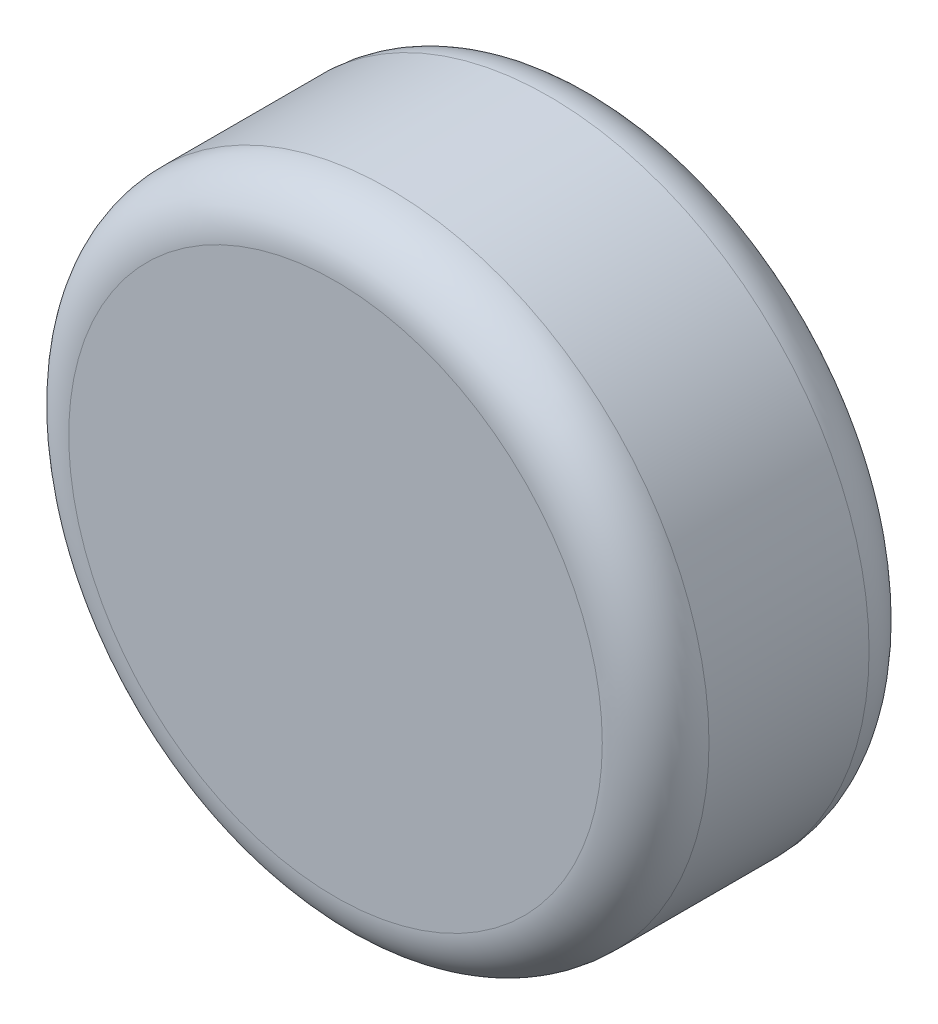
ISO-10303-21;
HEADER;
FILE_DESCRIPTION(('STEP AP214'),'2;1');
FILE_NAME('part.step','',(''),(''),'','','');
FILE_SCHEMA(('AUTOMOTIVE_DESIGN { 1 0 10303 214 1 1 1 1 }'));
ENDSEC;
DATA;
#1=APPLICATION_CONTEXT('core data for automotive mechanical design processes');
#2=APPLICATION_PROTOCOL_DEFINITION('international standard','automotive_design',2000,#1);
#3=PRODUCT_CONTEXT('',#1,'mechanical');
#4=PRODUCT('Part','Part','',(#3));
#5=PRODUCT_RELATED_PRODUCT_CATEGORY('part','',(#4));
#6=PRODUCT_DEFINITION_FORMATION('','',#4);
#7=PRODUCT_DEFINITION_CONTEXT('part definition',#1,'design');
#8=PRODUCT_DEFINITION('design','',#6,#7);
#9=PRODUCT_DEFINITION_SHAPE('','',#8);
#10=(LENGTH_UNIT() NAMED_UNIT(*) SI_UNIT(.MILLI.,.METRE.));
#11=(NAMED_UNIT(*) PLANE_ANGLE_UNIT() SI_UNIT($,.RADIAN.));
#12=(NAMED_UNIT(*) SI_UNIT($,.STERADIAN.) SOLID_ANGLE_UNIT());
#13=UNCERTAINTY_MEASURE_WITH_UNIT(LENGTH_MEASURE(1.E-05),#10,'distance_accuracy_value','');
#14=(GEOMETRIC_REPRESENTATION_CONTEXT(3) GLOBAL_UNCERTAINTY_ASSIGNED_CONTEXT((#13)) GLOBAL_UNIT_ASSIGNED_CONTEXT((#10,
#11,#12)) REPRESENTATION_CONTEXT('',''));
#15=CARTESIAN_POINT('',(0.,0.,0.));
#16=DIRECTION('',(0.,0.,1.));
#17=DIRECTION('',(1.,0.,0.));
#18=AXIS2_PLACEMENT_3D('',#15,#16,#17);
#19=CARTESIAN_POINT('',(0.,0.,25.));
#20=DIRECTION('',(0.,0.,-1.));
#21=DIRECTION('',(-1.,0.,0.));
#22=AXIS2_PLACEMENT_3D('',#19,#20,#21);
#23=CYLINDRICAL_SURFACE('',#22,30.);
#24=CARTESIAN_POINT('',(0.,0.,5.));
#25=DIRECTION('',(0.,0.,1.));
#26=DIRECTION('',(1.,0.,0.));
#27=AXIS2_PLACEMENT_3D('',#24,#25,#26);
#28=CIRCLE('',#27,30.);
#29=CARTESIAN_POINT('',(30.,0.,5.));
#30=VERTEX_POINT('',#29);
#31=EDGE_CURVE('E50',#30,#30,#28,.T.);
#32=ORIENTED_EDGE('',*,*,#31,.T.);
#33=EDGE_LOOP('',(#32));
#34=FACE_BOUND('',#33,.T.);
#35=CARTESIAN_POINT('',(0.,0.,20.));
#36=DIRECTION('',(0.,0.,1.));
#37=DIRECTION('',(1.,0.,0.));
#38=AXIS2_PLACEMENT_3D('',#35,#36,#37);
#39=CIRCLE('',#38,30.);
#40=CARTESIAN_POINT('',(30.,0.,20.));
#41=VERTEX_POINT('',#40);
#42=EDGE_CURVE('E55',#41,#41,#39,.F.);
#43=ORIENTED_EDGE('',*,*,#42,.T.);
#44=EDGE_LOOP('',(#43));
#45=FACE_BOUND('',#44,.T.);
#46=ADVANCED_FACE('F37',(#34,#45),#23,.T.);
#47=CARTESIAN_POINT('',(0.,0.,25.));
#48=DIRECTION('',(0.,0.,1.));
#49=DIRECTION('',(1.,0.,0.));
#50=AXIS2_PLACEMENT_3D('',#47,#48,#49);
#51=PLANE('',#50);
#52=CARTESIAN_POINT('',(0.,0.,25.));
#53=DIRECTION('',(0.,0.,1.));
#54=DIRECTION('',(1.,0.,0.));
#55=AXIS2_PLACEMENT_3D('',#52,#53,#54);
#56=CIRCLE('',#55,25.);
#57=CARTESIAN_POINT('',(25.,0.,25.));
#58=VERTEX_POINT('',#57);
#59=EDGE_CURVE('E10',#58,#58,#56,.T.);
#60=ORIENTED_EDGE('',*,*,#59,.T.);
#61=EDGE_LOOP('',(#60));
#62=FACE_BOUND('',#61,.T.);
#63=ADVANCED_FACE('F72',(#62),#51,.T.);
#64=CARTESIAN_POINT('',(0.,0.,0.));
#65=DIRECTION('',(0.,0.,1.));
#66=DIRECTION('',(1.,0.,0.));
#67=AXIS2_PLACEMENT_3D('',#64,#65,#66);
#68=PLANE('',#67);
#69=CARTESIAN_POINT('',(0.,0.,0.));
#70=DIRECTION('',(0.,0.,1.));
#71=DIRECTION('',(1.,0.,0.));
#72=AXIS2_PLACEMENT_3D('',#69,#70,#71);
#73=CIRCLE('',#72,25.);
#74=CARTESIAN_POINT('',(25.,0.,0.));
#75=VERTEX_POINT('',#74);
#76=EDGE_CURVE('E45',#75,#75,#73,.F.);
#77=ORIENTED_EDGE('',*,*,#76,.T.);
#78=EDGE_LOOP('',(#77));
#79=FACE_BOUND('',#78,.T.);
#80=ADVANCED_FACE('F69',(#79),#68,.F.);
#81=CARTESIAN_POINT('',(0.,0.,5.));
#82=DIRECTION('',(0.,0.,1.));
#83=DIRECTION('',(1.,0.,0.));
#84=AXIS2_PLACEMENT_3D('',#81,#82,#83);
#85=TOROIDAL_SURFACE('',#84,25.,5.);
#86=ORIENTED_EDGE('',*,*,#76,.F.);
#87=EDGE_LOOP('',(#86));
#88=FACE_BOUND('',#87,.T.);
#89=ORIENTED_EDGE('',*,*,#31,.F.);
#90=EDGE_LOOP('',(#89));
#91=FACE_BOUND('',#90,.T.);
#92=ADVANCED_FACE('F65',(#88,#91),#85,.T.);
#93=CARTESIAN_POINT('',(0.,0.,20.));
#94=DIRECTION('',(0.,0.,1.));
#95=DIRECTION('',(1.,0.,0.));
#96=AXIS2_PLACEMENT_3D('',#93,#94,#95);
#97=TOROIDAL_SURFACE('',#96,25.,5.);
#98=ORIENTED_EDGE('',*,*,#42,.F.);
#99=EDGE_LOOP('',(#98));
#100=FACE_BOUND('',#99,.T.);
#101=ORIENTED_EDGE('',*,*,#59,.F.);
#102=EDGE_LOOP('',(#101));
#103=FACE_BOUND('',#102,.T.);
#104=ADVANCED_FACE('F39',(#100,#103),#97,.T.);
#105=CLOSED_SHELL('',(#46,#63,#80,#92,#104));
#106=MANIFOLD_SOLID_BREP('B2',#105);
#107=ADVANCED_BREP_SHAPE_REPRESENTATION('',(#18,#106),#14);
#108=SHAPE_DEFINITION_REPRESENTATION(#9,#107);
ENDSEC;
END-ISO-10303-21;
